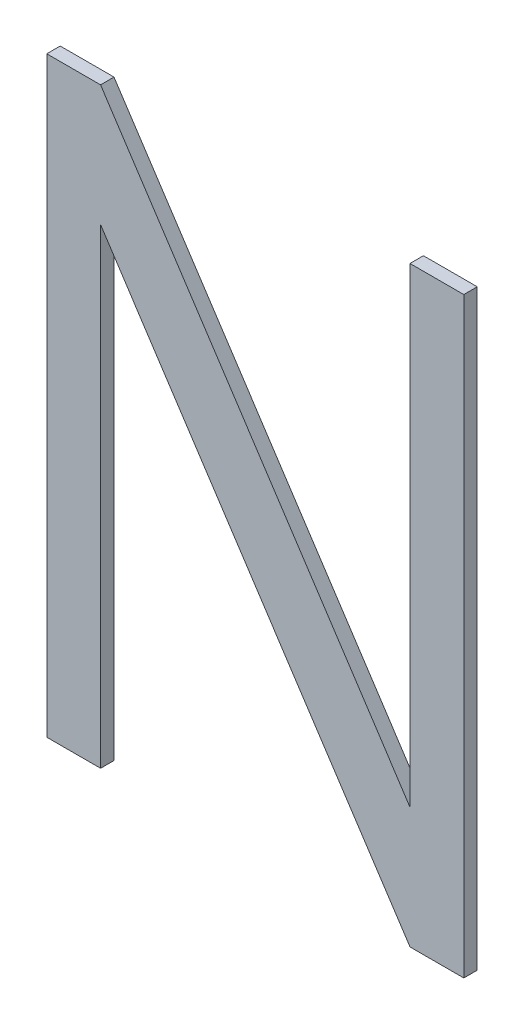
ISO-10303-21;
HEADER;
FILE_DESCRIPTION(('STEP AP214'),'2;1');
FILE_NAME('part.step','',(''),(''),'','','');
FILE_SCHEMA(('AUTOMOTIVE_DESIGN { 1 0 10303 214 1 1 1 1 }'));
ENDSEC;
DATA;
#1=APPLICATION_CONTEXT('core data for automotive mechanical design processes');
#2=APPLICATION_PROTOCOL_DEFINITION('international standard','automotive_design',2000,#1);
#3=PRODUCT_CONTEXT('',#1,'mechanical');
#4=PRODUCT('Part','Part','',(#3));
#5=PRODUCT_RELATED_PRODUCT_CATEGORY('part','',(#4));
#6=PRODUCT_DEFINITION_FORMATION('','',#4);
#7=PRODUCT_DEFINITION_CONTEXT('part definition',#1,'design');
#8=PRODUCT_DEFINITION('design','',#6,#7);
#9=PRODUCT_DEFINITION_SHAPE('','',#8);
#10=(LENGTH_UNIT() NAMED_UNIT(*) SI_UNIT(.MILLI.,.METRE.));
#11=(NAMED_UNIT(*) PLANE_ANGLE_UNIT() SI_UNIT($,.RADIAN.));
#12=(NAMED_UNIT(*) SI_UNIT($,.STERADIAN.) SOLID_ANGLE_UNIT());
#13=UNCERTAINTY_MEASURE_WITH_UNIT(LENGTH_MEASURE(1.E-05),#10,'distance_accuracy_value','');
#14=(GEOMETRIC_REPRESENTATION_CONTEXT(3) GLOBAL_UNCERTAINTY_ASSIGNED_CONTEXT((#13)) GLOBAL_UNIT_ASSIGNED_CONTEXT((#10,
#11,#12)) REPRESENTATION_CONTEXT('',''));
#15=CARTESIAN_POINT('',(0.,0.,0.));
#16=DIRECTION('',(0.,0.,1.));
#17=DIRECTION('',(1.,0.,0.));
#18=AXIS2_PLACEMENT_3D('',#15,#16,#17);
#19=CARTESIAN_POINT('',(-0.15499842,-0.21999956,0.01));
#20=DIRECTION('',(0.,0.,1.));
#21=DIRECTION('',(1.,0.,0.));
#22=AXIS2_PLACEMENT_3D('',#19,#20,#21);
#23=PLANE('',#22);
#24=DIRECTION('',(1.,0.,0.));
#25=VECTOR('',#24,1.);
#26=CARTESIAN_POINT('',(-0.15499842,0.2200021,0.01));
#27=LINE('',#26,#25);
#28=CARTESIAN_POINT('',(-0.15499842,0.2200021,0.01));
#29=VERTEX_POINT('',#28);
#30=CARTESIAN_POINT('',(-0.1149985,0.2200021,0.01));
#31=VERTEX_POINT('',#30);
#32=EDGE_CURVE('E137',#29,#31,#27,.T.);
#33=ORIENTED_EDGE('',*,*,#32,.F.);
#34=DIRECTION('',(0.,1.,0.));
#35=VECTOR('',#34,1.);
#36=CARTESIAN_POINT('',(-0.15499842,-0.21999956,0.01));
#37=LINE('',#36,#35);
#38=CARTESIAN_POINT('',(-0.15499842,-0.21999956,0.01));
#39=VERTEX_POINT('',#38);
#40=EDGE_CURVE('E106',#39,#29,#37,.T.);
#41=ORIENTED_EDGE('',*,*,#40,.F.);
#42=DIRECTION('',(1.,0.,0.));
#43=VECTOR('',#42,1.);
#44=CARTESIAN_POINT('',(-0.1149985,-0.21999956,0.01));
#45=LINE('',#44,#43);
#46=CARTESIAN_POINT('',(-0.1149985,-0.21999956,0.01));
#47=VERTEX_POINT('',#46);
#48=EDGE_CURVE('E20',#47,#39,#45,.F.);
#49=ORIENTED_EDGE('',*,*,#48,.F.);
#50=DIRECTION('',(0.,1.,0.));
#51=VECTOR('',#50,1.);
#52=CARTESIAN_POINT('',(-0.1149985,0.13000228,0.01));
#53=LINE('',#52,#51);
#54=CARTESIAN_POINT('',(-0.114998500000003,0.130002279999998,0.01));
#55=VERTEX_POINT('',#54);
#56=EDGE_CURVE('E95',#55,#47,#53,.F.);
#57=ORIENTED_EDGE('',*,*,#56,.F.);
#58=DIRECTION('',(0.549175103204889,-0.835707308822831,0.));
#59=VECTOR('',#58,1.);
#60=CARTESIAN_POINT('',(0.11500104,-0.21999956,0.01));
#61=LINE('',#60,#59);
#62=CARTESIAN_POINT('',(0.11500104,-0.21999956,0.01));
#63=VERTEX_POINT('',#62);
#64=EDGE_CURVE('E90',#63,#55,#61,.F.);
#65=ORIENTED_EDGE('',*,*,#64,.F.);
#66=DIRECTION('',(1.,0.,0.));
#67=VECTOR('',#66,1.);
#68=CARTESIAN_POINT('',(0.15500096,-0.21999956,0.01));
#69=LINE('',#68,#67);
#70=CARTESIAN_POINT('',(0.15500096,-0.21999956,0.01));
#71=VERTEX_POINT('',#70);
#72=EDGE_CURVE('E117',#71,#63,#69,.F.);
#73=ORIENTED_EDGE('',*,*,#72,.F.);
#74=DIRECTION('',(0.,1.,0.));
#75=VECTOR('',#74,1.);
#76=CARTESIAN_POINT('',(0.15500096,0.2200021,0.01));
#77=LINE('',#76,#75);
#78=CARTESIAN_POINT('',(0.15500096,0.2200021,0.01));
#79=VERTEX_POINT('',#78);
#80=EDGE_CURVE('E121',#79,#71,#77,.F.);
#81=ORIENTED_EDGE('',*,*,#80,.F.);
#82=DIRECTION('',(1.,0.,0.));
#83=VECTOR('',#82,1.);
#84=CARTESIAN_POINT('',(0.11500104,0.2200021,0.01));
#85=LINE('',#84,#83);
#86=CARTESIAN_POINT('',(0.11500104,0.2200021,0.01));
#87=VERTEX_POINT('',#86);
#88=EDGE_CURVE('E125',#87,#79,#85,.T.);
#89=ORIENTED_EDGE('',*,*,#88,.F.);
#90=DIRECTION('',(0.,1.,0.));
#91=VECTOR('',#90,1.);
#92=CARTESIAN_POINT('',(0.11500104,-0.1299972,0.01));
#93=LINE('',#92,#91);
#94=CARTESIAN_POINT('',(0.115001040000025,-0.129997199999983,0.01));
#95=VERTEX_POINT('',#94);
#96=EDGE_CURVE('E129',#95,#87,#93,.T.);
#97=ORIENTED_EDGE('',*,*,#96,.F.);
#98=DIRECTION('',(-0.549177886661077,0.835705479701117,0.));
#99=VECTOR('',#98,1.);
#100=CARTESIAN_POINT('',(-0.1149985,0.2200021,0.01));
#101=LINE('',#100,#99);
#102=EDGE_CURVE('E133',#31,#95,#101,.F.);
#103=ORIENTED_EDGE('',*,*,#102,.F.);
#104=EDGE_LOOP('',(#33,#41,#49,#57,#65,#73,#81,#89,#97,#103));
#105=FACE_BOUND('',#104,.T.);
#106=ADVANCED_FACE('F17',(#105),#23,.T.);
#107=CARTESIAN_POINT('',(-0.1149985,-0.21999956,0.));
#108=DIRECTION('',(0.,-1.,0.));
#109=DIRECTION('',(0.,0.,-1.));
#110=AXIS2_PLACEMENT_3D('',#107,#108,#109);
#111=PLANE('',#110);
#112=DIRECTION('',(0.,0.,1.));
#113=VECTOR('',#112,1.);
#114=CARTESIAN_POINT('',(-0.15499842,-0.21999956,0.));
#115=LINE('',#114,#113);
#116=CARTESIAN_POINT('',(-0.15499842,-0.21999956,0.));
#117=VERTEX_POINT('',#116);
#118=EDGE_CURVE('E141',#117,#39,#115,.T.);
#119=ORIENTED_EDGE('',*,*,#118,.F.);
#120=DIRECTION('',(1.,0.,0.));
#121=VECTOR('',#120,1.);
#122=CARTESIAN_POINT('',(-0.15499842,-0.21999956,0.));
#123=LINE('',#122,#121);
#124=CARTESIAN_POINT('',(-0.1149985,-0.21999956,0.));
#125=VERTEX_POINT('',#124);
#126=EDGE_CURVE('E112',#117,#125,#123,.T.);
#127=ORIENTED_EDGE('',*,*,#126,.T.);
#128=DIRECTION('',(0.,0.,-1.));
#129=VECTOR('',#128,1.);
#130=CARTESIAN_POINT('',(-0.1149985,-0.21999956,0.));
#131=LINE('',#130,#129);
#132=EDGE_CURVE('E100',#47,#125,#131,.T.);
#133=ORIENTED_EDGE('',*,*,#132,.F.);
#134=ORIENTED_EDGE('',*,*,#48,.T.);
#135=EDGE_LOOP('',(#119,#127,#133,#134));
#136=FACE_BOUND('',#135,.T.);
#137=ADVANCED_FACE('F111',(#136),#111,.T.);
#138=CARTESIAN_POINT('',(-0.1149985,0.13000228,0.));
#139=DIRECTION('',(1.,0.,0.));
#140=DIRECTION('',(0.,0.,-1.));
#141=AXIS2_PLACEMENT_3D('',#138,#139,#140);
#142=PLANE('',#141);
#143=ORIENTED_EDGE('',*,*,#132,.T.);
#144=DIRECTION('',(0.,1.,0.));
#145=VECTOR('',#144,1.);
#146=CARTESIAN_POINT('',(-0.1149985,-0.21999956,0.));
#147=LINE('',#146,#145);
#148=CARTESIAN_POINT('',(-0.114998500000003,0.130002279999998,0.));
#149=VERTEX_POINT('',#148);
#150=EDGE_CURVE('E146',#125,#149,#147,.T.);
#151=ORIENTED_EDGE('',*,*,#150,.T.);
#152=DIRECTION('',(0.,0.,1.));
#153=VECTOR('',#152,1.);
#154=CARTESIAN_POINT('',(-0.11499850000001,0.130002279999993,0.));
#155=LINE('',#154,#153);
#156=EDGE_CURVE('E102',#55,#149,#155,.F.);
#157=ORIENTED_EDGE('',*,*,#156,.F.);
#158=ORIENTED_EDGE('',*,*,#56,.T.);
#159=EDGE_LOOP('',(#143,#151,#157,#158));
#160=FACE_BOUND('',#159,.T.);
#161=ADVANCED_FACE('F97',(#160),#142,.T.);
#162=CARTESIAN_POINT('',(0.11500104,-0.21999956,0.));
#163=DIRECTION('',(-0.835707308822831,-0.549175103204889,0.));
#164=DIRECTION('',(0.549175103204889,-0.835707308822831,0.));
#165=AXIS2_PLACEMENT_3D('',#162,#163,#164);
#166=PLANE('',#165);
#167=ORIENTED_EDGE('',*,*,#156,.T.);
#168=DIRECTION('',(0.549175103204865,-0.835707308822847,0.));
#169=VECTOR('',#168,1.);
#170=CARTESIAN_POINT('',(-0.1149985,0.13000228,0.));
#171=LINE('',#170,#169);
#172=CARTESIAN_POINT('',(0.11500104,-0.21999956,0.));
#173=VERTEX_POINT('',#172);
#174=EDGE_CURVE('E148',#149,#173,#171,.T.);
#175=ORIENTED_EDGE('',*,*,#174,.T.);
#176=DIRECTION('',(0.,0.,-1.));
#177=VECTOR('',#176,1.);
#178=CARTESIAN_POINT('',(0.11500104,-0.21999956,0.));
#179=LINE('',#178,#177);
#180=EDGE_CURVE('E119',#63,#173,#179,.T.);
#181=ORIENTED_EDGE('',*,*,#180,.F.);
#182=ORIENTED_EDGE('',*,*,#64,.T.);
#183=EDGE_LOOP('',(#167,#175,#181,#182));
#184=FACE_BOUND('',#183,.T.);
#185=ADVANCED_FACE('F198',(#184),#166,.T.);
#186=CARTESIAN_POINT('',(0.15500096,-0.21999956,0.));
#187=DIRECTION('',(0.,-1.,0.));
#188=DIRECTION('',(0.,0.,-1.));
#189=AXIS2_PLACEMENT_3D('',#186,#187,#188);
#190=PLANE('',#189);
#191=ORIENTED_EDGE('',*,*,#180,.T.);
#192=DIRECTION('',(1.,0.,0.));
#193=VECTOR('',#192,1.);
#194=CARTESIAN_POINT('',(-0.15499842,-0.21999956,0.));
#195=LINE('',#194,#193);
#196=CARTESIAN_POINT('',(0.15500096,-0.21999956,0.));
#197=VERTEX_POINT('',#196);
#198=EDGE_CURVE('E151',#173,#197,#195,.T.);
#199=ORIENTED_EDGE('',*,*,#198,.T.);
#200=DIRECTION('',(0.,0.,-1.));
#201=VECTOR('',#200,1.);
#202=CARTESIAN_POINT('',(0.15500096,-0.21999956,0.));
#203=LINE('',#202,#201);
#204=EDGE_CURVE('E123',#71,#197,#203,.T.);
#205=ORIENTED_EDGE('',*,*,#204,.F.);
#206=ORIENTED_EDGE('',*,*,#72,.T.);
#207=EDGE_LOOP('',(#191,#199,#205,#206));
#208=FACE_BOUND('',#207,.T.);
#209=ADVANCED_FACE('F197',(#208),#190,.T.);
#210=CARTESIAN_POINT('',(0.15500096,0.2200021,0.));
#211=DIRECTION('',(1.,0.,0.));
#212=DIRECTION('',(0.,0.,-1.));
#213=AXIS2_PLACEMENT_3D('',#210,#211,#212);
#214=PLANE('',#213);
#215=ORIENTED_EDGE('',*,*,#204,.T.);
#216=DIRECTION('',(0.,1.,0.));
#217=VECTOR('',#216,1.);
#218=CARTESIAN_POINT('',(0.15500096,-0.21999956,0.));
#219=LINE('',#218,#217);
#220=CARTESIAN_POINT('',(0.15500096,0.2200021,0.));
#221=VERTEX_POINT('',#220);
#222=EDGE_CURVE('E154',#197,#221,#219,.T.);
#223=ORIENTED_EDGE('',*,*,#222,.T.);
#224=DIRECTION('',(0.,0.,1.));
#225=VECTOR('',#224,1.);
#226=CARTESIAN_POINT('',(0.15500096,0.2200021,0.));
#227=LINE('',#226,#225);
#228=EDGE_CURVE('E127',#79,#221,#227,.F.);
#229=ORIENTED_EDGE('',*,*,#228,.F.);
#230=ORIENTED_EDGE('',*,*,#80,.T.);
#231=EDGE_LOOP('',(#215,#223,#229,#230));
#232=FACE_BOUND('',#231,.T.);
#233=ADVANCED_FACE('F191',(#232),#214,.T.);
#234=CARTESIAN_POINT('',(0.11500104,0.2200021,0.));
#235=DIRECTION('',(0.,1.,0.));
#236=DIRECTION('',(0.,0.,1.));
#237=AXIS2_PLACEMENT_3D('',#234,#235,#236);
#238=PLANE('',#237);
#239=ORIENTED_EDGE('',*,*,#228,.T.);
#240=DIRECTION('',(1.,0.,0.));
#241=VECTOR('',#240,1.);
#242=CARTESIAN_POINT('',(-0.15499842,0.2200021,0.));
#243=LINE('',#242,#241);
#244=CARTESIAN_POINT('',(0.11500104,0.2200021,0.));
#245=VERTEX_POINT('',#244);
#246=EDGE_CURVE('E157',#221,#245,#243,.F.);
#247=ORIENTED_EDGE('',*,*,#246,.T.);
#248=DIRECTION('',(0.,0.,1.));
#249=VECTOR('',#248,1.);
#250=CARTESIAN_POINT('',(0.11500104,0.2200021,0.));
#251=LINE('',#250,#249);
#252=EDGE_CURVE('E131',#87,#245,#251,.F.);
#253=ORIENTED_EDGE('',*,*,#252,.F.);
#254=ORIENTED_EDGE('',*,*,#88,.T.);
#255=EDGE_LOOP('',(#239,#247,#253,#254));
#256=FACE_BOUND('',#255,.T.);
#257=ADVANCED_FACE('F187',(#256),#238,.T.);
#258=CARTESIAN_POINT('',(0.11500104,-0.1299972,0.));
#259=DIRECTION('',(-1.,0.,0.));
#260=DIRECTION('',(0.,0.,1.));
#261=AXIS2_PLACEMENT_3D('',#258,#259,#260);
#262=PLANE('',#261);
#263=ORIENTED_EDGE('',*,*,#252,.T.);
#264=DIRECTION('',(0.,1.,0.));
#265=VECTOR('',#264,1.);
#266=CARTESIAN_POINT('',(0.11500104,-0.21999956,0.));
#267=LINE('',#266,#265);
#268=CARTESIAN_POINT('',(0.115001040000025,-0.129997199999983,0.));
#269=VERTEX_POINT('',#268);
#270=EDGE_CURVE('E160',#245,#269,#267,.F.);
#271=ORIENTED_EDGE('',*,*,#270,.T.);
#272=DIRECTION('',(0.,0.,1.));
#273=VECTOR('',#272,1.);
#274=CARTESIAN_POINT('',(0.1150010400001,-0.129997199999934,0.));
#275=LINE('',#274,#273);
#276=EDGE_CURVE('E135',#95,#269,#275,.F.);
#277=ORIENTED_EDGE('',*,*,#276,.F.);
#278=ORIENTED_EDGE('',*,*,#96,.T.);
#279=EDGE_LOOP('',(#263,#271,#277,#278));
#280=FACE_BOUND('',#279,.T.);
#281=ADVANCED_FACE('F181',(#280),#262,.T.);
#282=CARTESIAN_POINT('',(-0.1149985,0.2200021,0.));
#283=DIRECTION('',(0.835705479701117,0.549177886661077,0.));
#284=DIRECTION('',(-0.549177886661077,0.835705479701117,0.));
#285=AXIS2_PLACEMENT_3D('',#282,#283,#284);
#286=PLANE('',#285);
#287=ORIENTED_EDGE('',*,*,#276,.T.);
#288=DIRECTION('',(-0.549177886660837,0.835705479701274,0.));
#289=VECTOR('',#288,1.);
#290=CARTESIAN_POINT('',(0.11500104,-0.1299972,0.));
#291=LINE('',#290,#289);
#292=CARTESIAN_POINT('',(-0.1149985,0.2200021,0.));
#293=VERTEX_POINT('',#292);
#294=EDGE_CURVE('E163',#269,#293,#291,.T.);
#295=ORIENTED_EDGE('',*,*,#294,.T.);
#296=DIRECTION('',(0.,0.,1.));
#297=VECTOR('',#296,1.);
#298=CARTESIAN_POINT('',(-0.1149985,0.2200021,0.));
#299=LINE('',#298,#297);
#300=EDGE_CURVE('E139',#31,#293,#299,.F.);
#301=ORIENTED_EDGE('',*,*,#300,.F.);
#302=ORIENTED_EDGE('',*,*,#102,.T.);
#303=EDGE_LOOP('',(#287,#295,#301,#302));
#304=FACE_BOUND('',#303,.T.);
#305=ADVANCED_FACE('F176',(#304),#286,.T.);
#306=CARTESIAN_POINT('',(-0.15499842,0.2200021,0.));
#307=DIRECTION('',(0.,1.,0.));
#308=DIRECTION('',(0.,0.,1.));
#309=AXIS2_PLACEMENT_3D('',#306,#307,#308);
#310=PLANE('',#309);
#311=ORIENTED_EDGE('',*,*,#300,.T.);
#312=DIRECTION('',(1.,0.,0.));
#313=VECTOR('',#312,1.);
#314=CARTESIAN_POINT('',(-0.15499842,0.2200021,0.));
#315=LINE('',#314,#313);
#316=CARTESIAN_POINT('',(-0.15499842,0.2200021,0.));
#317=VERTEX_POINT('',#316);
#318=EDGE_CURVE('E26',#293,#317,#315,.F.);
#319=ORIENTED_EDGE('',*,*,#318,.T.);
#320=DIRECTION('',(0.,0.,1.));
#321=VECTOR('',#320,1.);
#322=CARTESIAN_POINT('',(-0.15499842,0.2200021,0.));
#323=LINE('',#322,#321);
#324=EDGE_CURVE('E34',#29,#317,#323,.F.);
#325=ORIENTED_EDGE('',*,*,#324,.F.);
#326=ORIENTED_EDGE('',*,*,#32,.T.);
#327=EDGE_LOOP('',(#311,#319,#325,#326));
#328=FACE_BOUND('',#327,.T.);
#329=ADVANCED_FACE('F169',(#328),#310,.T.);
#330=CARTESIAN_POINT('',(-0.15499842,-0.21999956,0.));
#331=DIRECTION('',(-1.,0.,0.));
#332=DIRECTION('',(0.,0.,1.));
#333=AXIS2_PLACEMENT_3D('',#330,#331,#332);
#334=PLANE('',#333);
#335=ORIENTED_EDGE('',*,*,#324,.T.);
#336=DIRECTION('',(0.,1.,0.));
#337=VECTOR('',#336,1.);
#338=CARTESIAN_POINT('',(-0.15499842,-0.21999956,0.));
#339=LINE('',#338,#337);
#340=EDGE_CURVE('E11',#317,#117,#339,.F.);
#341=ORIENTED_EDGE('',*,*,#340,.T.);
#342=ORIENTED_EDGE('',*,*,#118,.T.);
#343=ORIENTED_EDGE('',*,*,#40,.T.);
#344=EDGE_LOOP('',(#335,#341,#342,#343));
#345=FACE_BOUND('',#344,.T.);
#346=ADVANCED_FACE('F199',(#345),#334,.T.);
#347=CARTESIAN_POINT('',(-0.15499842,-0.21999956,0.));
#348=DIRECTION('',(0.,0.,1.));
#349=DIRECTION('',(1.,0.,0.));
#350=AXIS2_PLACEMENT_3D('',#347,#348,#349);
#351=PLANE('',#350);
#352=ORIENTED_EDGE('',*,*,#318,.F.);
#353=ORIENTED_EDGE('',*,*,#294,.F.);
#354=ORIENTED_EDGE('',*,*,#270,.F.);
#355=ORIENTED_EDGE('',*,*,#246,.F.);
#356=ORIENTED_EDGE('',*,*,#222,.F.);
#357=ORIENTED_EDGE('',*,*,#198,.F.);
#358=ORIENTED_EDGE('',*,*,#174,.F.);
#359=ORIENTED_EDGE('',*,*,#150,.F.);
#360=ORIENTED_EDGE('',*,*,#126,.F.);
#361=ORIENTED_EDGE('',*,*,#340,.F.);
#362=EDGE_LOOP('',(#352,#353,#354,#355,#356,#357,#358,#359,#360,#361));
#363=FACE_BOUND('',#362,.T.);
#364=ADVANCED_FACE('F173',(#363),#351,.F.);
#365=CLOSED_SHELL('',(#106,#137,#161,#185,#209,#233,#257,#281,#305,#329,#346,#364));
#366=MANIFOLD_SOLID_BREP('B1',#365);
#367=ADVANCED_BREP_SHAPE_REPRESENTATION('',(#18,#366),#14);
#368=SHAPE_DEFINITION_REPRESENTATION(#9,#367);
ENDSEC;
END-ISO-10303-21;
